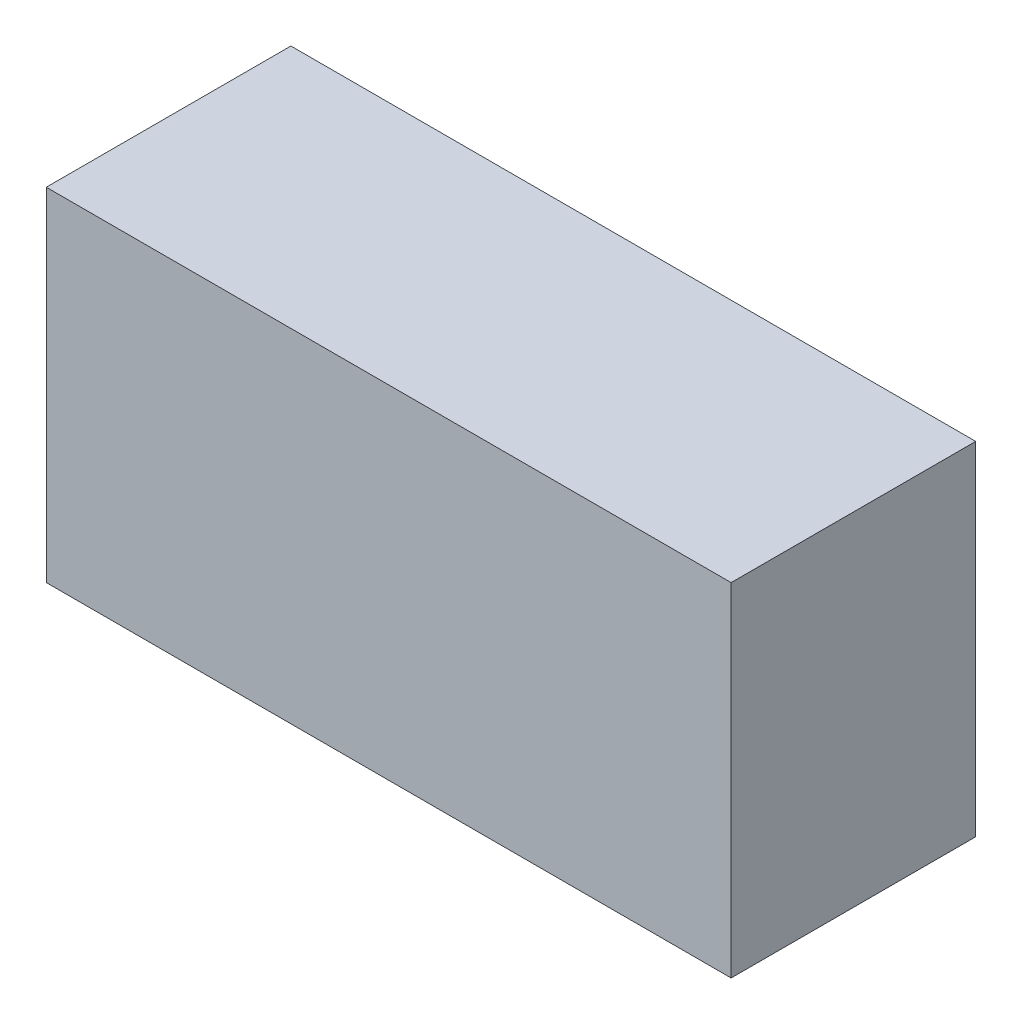
ISO-10303-21;
HEADER;
FILE_DESCRIPTION(('STEP AP214'),'2;1');
FILE_NAME('part.step','',(''),(''),'','','');
FILE_SCHEMA(('AUTOMOTIVE_DESIGN { 1 0 10303 214 1 1 1 1 }'));
ENDSEC;
DATA;
#1=APPLICATION_CONTEXT('core data for automotive mechanical design processes');
#2=APPLICATION_PROTOCOL_DEFINITION('international standard','automotive_design',2000,#1);
#3=PRODUCT_CONTEXT('',#1,'mechanical');
#4=PRODUCT('Part','Part','',(#3));
#5=PRODUCT_RELATED_PRODUCT_CATEGORY('part','',(#4));
#6=PRODUCT_DEFINITION_FORMATION('','',#4);
#7=PRODUCT_DEFINITION_CONTEXT('part definition',#1,'design');
#8=PRODUCT_DEFINITION('design','',#6,#7);
#9=PRODUCT_DEFINITION_SHAPE('','',#8);
#10=(LENGTH_UNIT() NAMED_UNIT(*) SI_UNIT(.MILLI.,.METRE.));
#11=(NAMED_UNIT(*) PLANE_ANGLE_UNIT() SI_UNIT($,.RADIAN.));
#12=(NAMED_UNIT(*) SI_UNIT($,.STERADIAN.) SOLID_ANGLE_UNIT());
#13=UNCERTAINTY_MEASURE_WITH_UNIT(LENGTH_MEASURE(1.E-05),#10,'distance_accuracy_value','');
#14=(GEOMETRIC_REPRESENTATION_CONTEXT(3) GLOBAL_UNCERTAINTY_ASSIGNED_CONTEXT((#13)) GLOBAL_UNIT_ASSIGNED_CONTEXT((#10,
#11,#12)) REPRESENTATION_CONTEXT('',''));
#15=CARTESIAN_POINT('',(0.,0.,0.));
#16=DIRECTION('',(0.,0.,1.));
#17=DIRECTION('',(1.,0.,0.));
#18=AXIS2_PLACEMENT_3D('',#15,#16,#17);
#19=CARTESIAN_POINT('',(0.,0.,25.));
#20=DIRECTION('',(1.,0.,0.));
#21=DIRECTION('',(0.,0.,-1.));
#22=AXIS2_PLACEMENT_3D('',#19,#20,#21);
#23=PLANE('',#22);
#24=DIRECTION('',(0.,-1.,0.));
#25=VECTOR('',#24,1.);
#26=CARTESIAN_POINT('',(0.,0.,0.));
#27=LINE('',#26,#25);
#28=CARTESIAN_POINT('',(0.,35.,0.));
#29=VERTEX_POINT('',#28);
#30=CARTESIAN_POINT('',(0.,0.,0.));
#31=VERTEX_POINT('',#30);
#32=EDGE_CURVE('E96',#29,#31,#27,.T.);
#33=ORIENTED_EDGE('',*,*,#32,.T.);
#34=DIRECTION('',(0.,0.,-1.));
#35=VECTOR('',#34,1.);
#36=CARTESIAN_POINT('',(0.,0.,25.));
#37=LINE('',#36,#35);
#38=CARTESIAN_POINT('',(0.,0.,25.));
#39=VERTEX_POINT('',#38);
#40=EDGE_CURVE('E11',#39,#31,#37,.T.);
#41=ORIENTED_EDGE('',*,*,#40,.F.);
#42=DIRECTION('',(0.,-1.,0.));
#43=VECTOR('',#42,1.);
#44=CARTESIAN_POINT('',(0.,0.,25.));
#45=LINE('',#44,#43);
#46=CARTESIAN_POINT('',(0.,35.,25.));
#47=VERTEX_POINT('',#46);
#48=EDGE_CURVE('E84',#47,#39,#45,.T.);
#49=ORIENTED_EDGE('',*,*,#48,.F.);
#50=DIRECTION('',(0.,0.,-1.));
#51=VECTOR('',#50,1.);
#52=CARTESIAN_POINT('',(0.,35.,25.));
#53=LINE('',#52,#51);
#54=EDGE_CURVE('E92',#47,#29,#53,.T.);
#55=ORIENTED_EDGE('',*,*,#54,.T.);
#56=EDGE_LOOP('',(#33,#41,#49,#55));
#57=FACE_BOUND('',#56,.T.);
#58=ADVANCED_FACE('F33',(#57),#23,.F.);
#59=CARTESIAN_POINT('',(0.,0.,25.));
#60=DIRECTION('',(0.,1.,0.));
#61=DIRECTION('',(0.,0.,1.));
#62=AXIS2_PLACEMENT_3D('',#59,#60,#61);
#63=PLANE('',#62);
#64=DIRECTION('',(1.,0.,0.));
#65=VECTOR('',#64,1.);
#66=CARTESIAN_POINT('',(0.,0.,0.));
#67=LINE('',#66,#65);
#68=CARTESIAN_POINT('',(70.,0.,0.));
#69=VERTEX_POINT('',#68);
#70=EDGE_CURVE('E88',#31,#69,#67,.T.);
#71=ORIENTED_EDGE('',*,*,#70,.T.);
#72=DIRECTION('',(0.,0.,-1.));
#73=VECTOR('',#72,1.);
#74=CARTESIAN_POINT('',(70.,0.,25.));
#75=LINE('',#74,#73);
#76=CARTESIAN_POINT('',(70.,0.,25.));
#77=VERTEX_POINT('',#76);
#78=EDGE_CURVE('E41',#77,#69,#75,.T.);
#79=ORIENTED_EDGE('',*,*,#78,.F.);
#80=DIRECTION('',(1.,0.,0.));
#81=VECTOR('',#80,1.);
#82=CARTESIAN_POINT('',(0.,0.,25.));
#83=LINE('',#82,#81);
#84=EDGE_CURVE('E79',#39,#77,#83,.T.);
#85=ORIENTED_EDGE('',*,*,#84,.F.);
#86=ORIENTED_EDGE('',*,*,#40,.T.);
#87=EDGE_LOOP('',(#71,#79,#85,#86));
#88=FACE_BOUND('',#87,.T.);
#89=ADVANCED_FACE('F87',(#88),#63,.F.);
#90=CARTESIAN_POINT('',(70.,0.,25.));
#91=DIRECTION('',(-1.,0.,0.));
#92=DIRECTION('',(0.,0.,1.));
#93=AXIS2_PLACEMENT_3D('',#90,#91,#92);
#94=PLANE('',#93);
#95=DIRECTION('',(0.,1.,0.));
#96=VECTOR('',#95,1.);
#97=CARTESIAN_POINT('',(70.,0.,0.));
#98=LINE('',#97,#96);
#99=CARTESIAN_POINT('',(70.,35.,0.));
#100=VERTEX_POINT('',#99);
#101=EDGE_CURVE('E66',#69,#100,#98,.T.);
#102=ORIENTED_EDGE('',*,*,#101,.T.);
#103=DIRECTION('',(0.,0.,-1.));
#104=VECTOR('',#103,1.);
#105=CARTESIAN_POINT('',(70.,35.,25.));
#106=LINE('',#105,#104);
#107=CARTESIAN_POINT('',(70.,35.,25.));
#108=VERTEX_POINT('',#107);
#109=EDGE_CURVE('E89',#108,#100,#106,.T.);
#110=ORIENTED_EDGE('',*,*,#109,.F.);
#111=DIRECTION('',(0.,1.,0.));
#112=VECTOR('',#111,1.);
#113=CARTESIAN_POINT('',(70.,0.,25.));
#114=LINE('',#113,#112);
#115=EDGE_CURVE('E82',#77,#108,#114,.T.);
#116=ORIENTED_EDGE('',*,*,#115,.F.);
#117=ORIENTED_EDGE('',*,*,#78,.T.);
#118=EDGE_LOOP('',(#102,#110,#116,#117));
#119=FACE_BOUND('',#118,.T.);
#120=ADVANCED_FACE('F90',(#119),#94,.F.);
#121=CARTESIAN_POINT('',(0.,35.,25.));
#122=DIRECTION('',(0.,-1.,0.));
#123=DIRECTION('',(0.,0.,-1.));
#124=AXIS2_PLACEMENT_3D('',#121,#122,#123);
#125=PLANE('',#124);
#126=DIRECTION('',(-1.,0.,0.));
#127=VECTOR('',#126,1.);
#128=CARTESIAN_POINT('',(0.,35.,0.));
#129=LINE('',#128,#127);
#130=EDGE_CURVE('E72',#100,#29,#129,.T.);
#131=ORIENTED_EDGE('',*,*,#130,.T.);
#132=ORIENTED_EDGE('',*,*,#54,.F.);
#133=DIRECTION('',(-1.,0.,0.));
#134=VECTOR('',#133,1.);
#135=CARTESIAN_POINT('',(0.,35.,25.));
#136=LINE('',#135,#134);
#137=EDGE_CURVE('E49',#108,#47,#136,.T.);
#138=ORIENTED_EDGE('',*,*,#137,.F.);
#139=ORIENTED_EDGE('',*,*,#109,.T.);
#140=EDGE_LOOP('',(#131,#132,#138,#139));
#141=FACE_BOUND('',#140,.T.);
#142=ADVANCED_FACE('F103',(#141),#125,.F.);
#143=CARTESIAN_POINT('',(0.,35.,25.));
#144=DIRECTION('',(0.,0.,-1.));
#145=DIRECTION('',(-1.,0.,0.));
#146=AXIS2_PLACEMENT_3D('',#143,#144,#145);
#147=PLANE('',#146);
#148=ORIENTED_EDGE('',*,*,#48,.T.);
#149=ORIENTED_EDGE('',*,*,#84,.T.);
#150=ORIENTED_EDGE('',*,*,#115,.T.);
#151=ORIENTED_EDGE('',*,*,#137,.T.);
#152=EDGE_LOOP('',(#148,#149,#150,#151));
#153=FACE_BOUND('',#152,.T.);
#154=ADVANCED_FACE('F80',(#153),#147,.F.);
#155=CARTESIAN_POINT('',(0.,35.,0.));
#156=DIRECTION('',(0.,0.,-1.));
#157=DIRECTION('',(-1.,0.,0.));
#158=AXIS2_PLACEMENT_3D('',#155,#156,#157);
#159=PLANE('',#158);
#160=ORIENTED_EDGE('',*,*,#32,.F.);
#161=ORIENTED_EDGE('',*,*,#130,.F.);
#162=ORIENTED_EDGE('',*,*,#101,.F.);
#163=ORIENTED_EDGE('',*,*,#70,.F.);
#164=EDGE_LOOP('',(#160,#161,#162,#163));
#165=FACE_BOUND('',#164,.T.);
#166=ADVANCED_FACE('F106',(#165),#159,.T.);
#167=CLOSED_SHELL('',(#58,#89,#120,#142,#154,#166));
#168=MANIFOLD_SOLID_BREP('B2',#167);
#169=ADVANCED_BREP_SHAPE_REPRESENTATION('',(#18,#168),#14);
#170=SHAPE_DEFINITION_REPRESENTATION(#9,#169);
ENDSEC;
END-ISO-10303-21;
